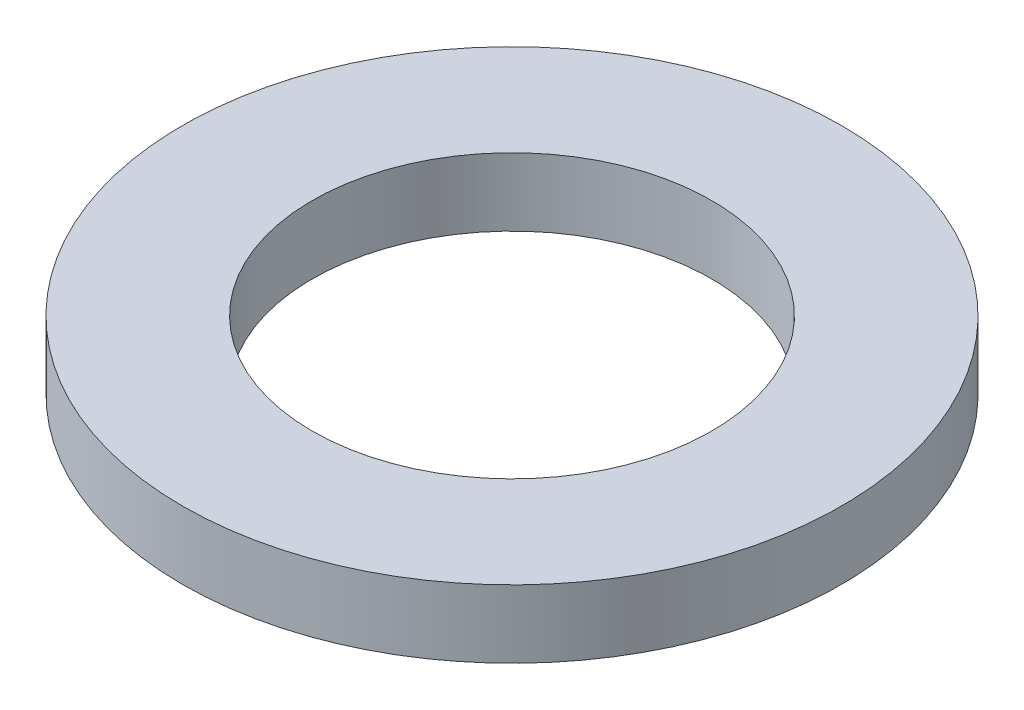
ISO-10303-21;
HEADER;
FILE_DESCRIPTION(('STEP AP214'),'2;1');
FILE_NAME('part.step','',(''),(''),'','','');
FILE_SCHEMA(('AUTOMOTIVE_DESIGN { 1 0 10303 214 1 1 1 1 }'));
ENDSEC;
DATA;
#1=APPLICATION_CONTEXT('core data for automotive mechanical design processes');
#2=APPLICATION_PROTOCOL_DEFINITION('international standard','automotive_design',2000,#1);
#3=PRODUCT_CONTEXT('',#1,'mechanical');
#4=PRODUCT('Part','Part','',(#3));
#5=PRODUCT_RELATED_PRODUCT_CATEGORY('part','',(#4));
#6=PRODUCT_DEFINITION_FORMATION('','',#4);
#7=PRODUCT_DEFINITION_CONTEXT('part definition',#1,'design');
#8=PRODUCT_DEFINITION('design','',#6,#7);
#9=PRODUCT_DEFINITION_SHAPE('','',#8);
#10=(LENGTH_UNIT() NAMED_UNIT(*) SI_UNIT(.MILLI.,.METRE.));
#11=(NAMED_UNIT(*) PLANE_ANGLE_UNIT() SI_UNIT($,.RADIAN.));
#12=(NAMED_UNIT(*) SI_UNIT($,.STERADIAN.) SOLID_ANGLE_UNIT());
#13=UNCERTAINTY_MEASURE_WITH_UNIT(LENGTH_MEASURE(1.E-05),#10,'distance_accuracy_value','');
#14=(GEOMETRIC_REPRESENTATION_CONTEXT(3) GLOBAL_UNCERTAINTY_ASSIGNED_CONTEXT((#13)) GLOBAL_UNIT_ASSIGNED_CONTEXT((#10,
#11,#12)) REPRESENTATION_CONTEXT('',''));
#15=CARTESIAN_POINT('',(0.,0.,0.));
#16=DIRECTION('',(0.,0.,1.));
#17=DIRECTION('',(1.,0.,0.));
#18=AXIS2_PLACEMENT_3D('',#15,#16,#17);
#19=CARTESIAN_POINT('',(0.,17.,0.));
#20=DIRECTION('',(0.,-1.,0.));
#21=DIRECTION('',(0.,0.,-1.));
#22=AXIS2_PLACEMENT_3D('',#19,#20,#21);
#23=CYLINDRICAL_SURFACE('',#22,82.5);
#24=CARTESIAN_POINT('',(0.,17.,0.));
#25=DIRECTION('',(0.,1.,0.));
#26=DIRECTION('',(0.,0.,1.));
#27=AXIS2_PLACEMENT_3D('',#24,#25,#26);
#28=CIRCLE('',#27,82.5);
#29=CARTESIAN_POINT('',(0.,17.,82.5));
#30=VERTEX_POINT('',#29);
#31=EDGE_CURVE('E10',#30,#30,#28,.T.);
#32=ORIENTED_EDGE('',*,*,#31,.F.);
#33=EDGE_LOOP('',(#32));
#34=FACE_BOUND('',#33,.T.);
#35=CARTESIAN_POINT('',(0.,0.,0.));
#36=DIRECTION('',(0.,1.,0.));
#37=DIRECTION('',(0.,0.,1.));
#38=AXIS2_PLACEMENT_3D('',#35,#36,#37);
#39=CIRCLE('',#38,82.5);
#40=CARTESIAN_POINT('',(0.,0.,82.5));
#41=VERTEX_POINT('',#40);
#42=EDGE_CURVE('E37',#41,#41,#39,.T.);
#43=ORIENTED_EDGE('',*,*,#42,.T.);
#44=EDGE_LOOP('',(#43));
#45=FACE_BOUND('',#44,.T.);
#46=ADVANCED_FACE('F40',(#34,#45),#23,.T.);
#47=CARTESIAN_POINT('',(0.,17.,0.));
#48=DIRECTION('',(0.,1.,0.));
#49=DIRECTION('',(0.,0.,1.));
#50=AXIS2_PLACEMENT_3D('',#47,#48,#49);
#51=PLANE('',#50);
#52=CARTESIAN_POINT('',(0.,17.,0.));
#53=DIRECTION('',(0.,1.,0.));
#54=DIRECTION('',(0.,0.,1.));
#55=AXIS2_PLACEMENT_3D('',#52,#53,#54);
#56=CIRCLE('',#55,50.);
#57=CARTESIAN_POINT('',(0.,17.,50.));
#58=VERTEX_POINT('',#57);
#59=EDGE_CURVE('E50',#58,#58,#56,.T.);
#60=ORIENTED_EDGE('',*,*,#59,.F.);
#61=EDGE_LOOP('',(#60));
#62=FACE_BOUND('',#61,.T.);
#63=ORIENTED_EDGE('',*,*,#31,.T.);
#64=EDGE_LOOP('',(#63));
#65=FACE_BOUND('',#64,.T.);
#66=ADVANCED_FACE('F59',(#62,#65),#51,.T.);
#67=CARTESIAN_POINT('',(0.,0.,0.));
#68=DIRECTION('',(0.,1.,0.));
#69=DIRECTION('',(0.,0.,1.));
#70=AXIS2_PLACEMENT_3D('',#67,#68,#69);
#71=PLANE('',#70);
#72=CARTESIAN_POINT('',(0.,0.,0.));
#73=DIRECTION('',(0.,1.,0.));
#74=DIRECTION('',(0.,0.,1.));
#75=AXIS2_PLACEMENT_3D('',#72,#73,#74);
#76=CIRCLE('',#75,50.);
#77=CARTESIAN_POINT('',(0.,0.,50.));
#78=VERTEX_POINT('',#77);
#79=EDGE_CURVE('E47',#78,#78,#76,.T.);
#80=ORIENTED_EDGE('',*,*,#79,.T.);
#81=EDGE_LOOP('',(#80));
#82=FACE_BOUND('',#81,.T.);
#83=ORIENTED_EDGE('',*,*,#42,.F.);
#84=EDGE_LOOP('',(#83));
#85=FACE_BOUND('',#84,.T.);
#86=ADVANCED_FACE('F58',(#82,#85),#71,.F.);
#87=CARTESIAN_POINT('',(0.,17.,0.));
#88=DIRECTION('',(0.,-1.,0.));
#89=DIRECTION('',(0.,0.,-1.));
#90=AXIS2_PLACEMENT_3D('',#87,#88,#89);
#91=CYLINDRICAL_SURFACE('',#90,50.);
#92=ORIENTED_EDGE('',*,*,#59,.T.);
#93=EDGE_LOOP('',(#92));
#94=FACE_BOUND('',#93,.T.);
#95=ORIENTED_EDGE('',*,*,#79,.F.);
#96=EDGE_LOOP('',(#95));
#97=FACE_BOUND('',#96,.T.);
#98=ADVANCED_FACE('F54',(#94,#97),#91,.F.);
#99=CLOSED_SHELL('',(#46,#66,#86,#98));
#100=MANIFOLD_SOLID_BREP('B2',#99);
#101=ADVANCED_BREP_SHAPE_REPRESENTATION('',(#18,#100),#14);
#102=SHAPE_DEFINITION_REPRESENTATION(#9,#101);
ENDSEC;
END-ISO-10303-21;
